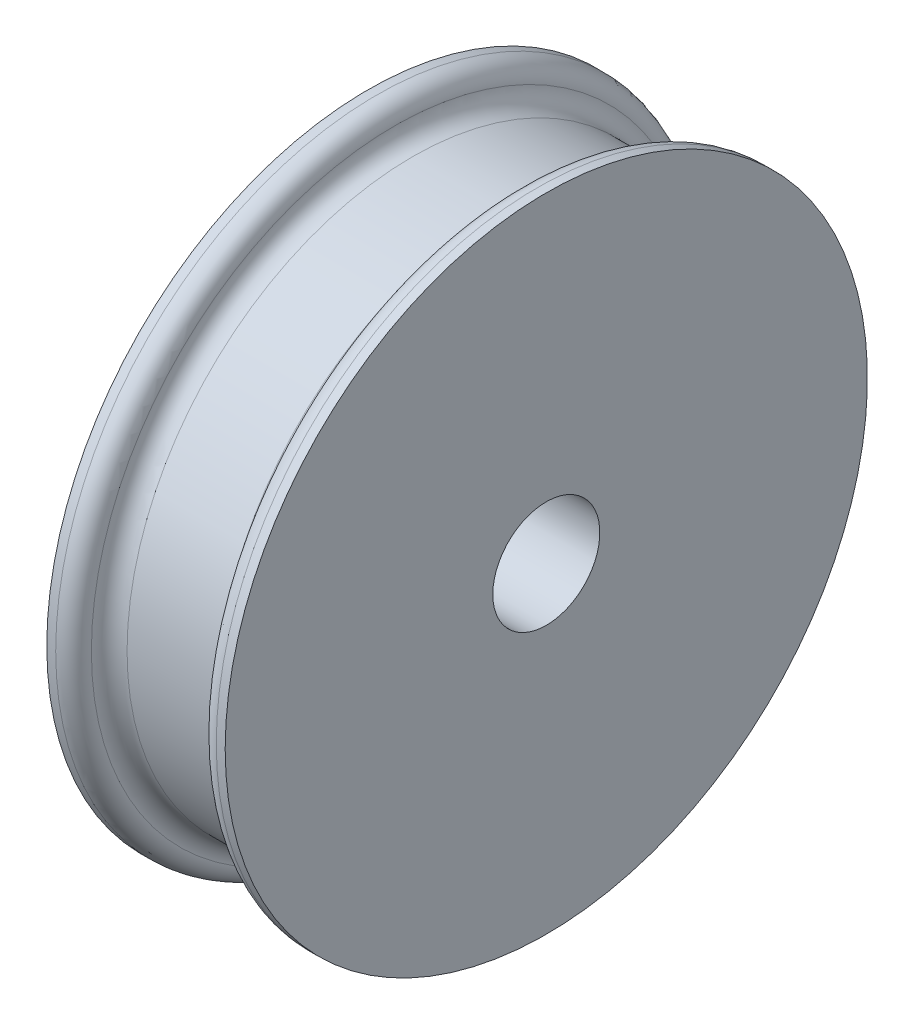
ISO-10303-21;
HEADER;
FILE_DESCRIPTION(('STEP AP214'),'2;1');
FILE_NAME('part.step','',(''),(''),'','','');
FILE_SCHEMA(('AUTOMOTIVE_DESIGN { 1 0 10303 214 1 1 1 1 }'));
ENDSEC;
DATA;
#1=APPLICATION_CONTEXT('core data for automotive mechanical design processes');
#2=APPLICATION_PROTOCOL_DEFINITION('international standard','automotive_design',2000,#1);
#3=PRODUCT_CONTEXT('',#1,'mechanical');
#4=PRODUCT('Part','Part','',(#3));
#5=PRODUCT_RELATED_PRODUCT_CATEGORY('part','',(#4));
#6=PRODUCT_DEFINITION_FORMATION('','',#4);
#7=PRODUCT_DEFINITION_CONTEXT('part definition',#1,'design');
#8=PRODUCT_DEFINITION('design','',#6,#7);
#9=PRODUCT_DEFINITION_SHAPE('','',#8);
#10=(LENGTH_UNIT() NAMED_UNIT(*) SI_UNIT(.MILLI.,.METRE.));
#11=(NAMED_UNIT(*) PLANE_ANGLE_UNIT() SI_UNIT($,.RADIAN.));
#12=(NAMED_UNIT(*) SI_UNIT($,.STERADIAN.) SOLID_ANGLE_UNIT());
#13=UNCERTAINTY_MEASURE_WITH_UNIT(LENGTH_MEASURE(1.E-05),#10,'distance_accuracy_value','');
#14=(GEOMETRIC_REPRESENTATION_CONTEXT(3) GLOBAL_UNCERTAINTY_ASSIGNED_CONTEXT((#13)) GLOBAL_UNIT_ASSIGNED_CONTEXT((#10,
#11,#12)) REPRESENTATION_CONTEXT('',''));
#15=CARTESIAN_POINT('',(0.,0.,0.));
#16=DIRECTION('',(0.,0.,1.));
#17=DIRECTION('',(1.,0.,0.));
#18=AXIS2_PLACEMENT_3D('',#15,#16,#17);
#19=CARTESIAN_POINT('',(2.5,1.5,0.));
#20=DIRECTION('',(-1.,0.,0.));
#21=DIRECTION('',(0.,0.,1.));
#22=AXIS2_PLACEMENT_3D('',#19,#20,#21);
#23=PLANE('',#22);
#24=CARTESIAN_POINT('',(2.5,0.,0.));
#25=DIRECTION('',(-1.,0.,0.));
#26=DIRECTION('',(0.,0.,1.));
#27=AXIS2_PLACEMENT_3D('',#24,#25,#26);
#28=CIRCLE('',#27,9.);
#29=CARTESIAN_POINT('',(2.5,0.,9.));
#30=VERTEX_POINT('',#29);
#31=EDGE_CURVE('E65',#30,#30,#28,.T.);
#32=ORIENTED_EDGE('',*,*,#31,.F.);
#33=EDGE_LOOP('',(#32));
#34=FACE_BOUND('',#33,.T.);
#35=CARTESIAN_POINT('',(2.5,0.,0.));
#36=DIRECTION('',(-1.,0.,0.));
#37=DIRECTION('',(0.,0.,1.));
#38=AXIS2_PLACEMENT_3D('',#35,#36,#37);
#39=CIRCLE('',#38,1.5);
#40=CARTESIAN_POINT('',(2.5,0.,1.5));
#41=VERTEX_POINT('',#40);
#42=EDGE_CURVE('E41',#41,#41,#39,.T.);
#43=ORIENTED_EDGE('',*,*,#42,.T.);
#44=EDGE_LOOP('',(#43));
#45=FACE_BOUND('',#44,.T.);
#46=ADVANCED_FACE('F30',(#34,#45),#23,.F.);
#47=CARTESIAN_POINT('',(0.,0.,0.));
#48=DIRECTION('',(-1.,0.,0.));
#49=DIRECTION('',(0.,0.,1.));
#50=AXIS2_PLACEMENT_3D('',#47,#48,#49);
#51=CYLINDRICAL_SURFACE('',#50,1.5);
#52=ORIENTED_EDGE('',*,*,#42,.F.);
#53=EDGE_LOOP('',(#52));
#54=FACE_BOUND('',#53,.T.);
#55=CARTESIAN_POINT('',(-2.5,0.,0.));
#56=DIRECTION('',(-1.,0.,0.));
#57=DIRECTION('',(0.,0.,1.));
#58=AXIS2_PLACEMENT_3D('',#55,#56,#57);
#59=CIRCLE('',#58,1.5);
#60=CARTESIAN_POINT('',(-2.5,0.,1.5));
#61=VERTEX_POINT('',#60);
#62=EDGE_CURVE('E45',#61,#61,#59,.T.);
#63=ORIENTED_EDGE('',*,*,#62,.T.);
#64=EDGE_LOOP('',(#63));
#65=FACE_BOUND('',#64,.T.);
#66=ADVANCED_FACE('F73',(#54,#65),#51,.F.);
#67=CARTESIAN_POINT('',(-2.5,1.5,0.));
#68=DIRECTION('',(1.,0.,0.));
#69=DIRECTION('',(0.,0.,-1.));
#70=AXIS2_PLACEMENT_3D('',#67,#68,#69);
#71=PLANE('',#70);
#72=ORIENTED_EDGE('',*,*,#62,.F.);
#73=EDGE_LOOP('',(#72));
#74=FACE_BOUND('',#73,.T.);
#75=CARTESIAN_POINT('',(-2.5,0.,0.));
#76=DIRECTION('',(-1.,0.,0.));
#77=DIRECTION('',(0.,0.,1.));
#78=AXIS2_PLACEMENT_3D('',#75,#76,#77);
#79=CIRCLE('',#78,9.);
#80=CARTESIAN_POINT('',(-2.5,0.,9.));
#81=VERTEX_POINT('',#80);
#82=EDGE_CURVE('E50',#81,#81,#79,.T.);
#83=ORIENTED_EDGE('',*,*,#82,.T.);
#84=EDGE_LOOP('',(#83));
#85=FACE_BOUND('',#84,.T.);
#86=ADVANCED_FACE('F79',(#74,#85),#71,.F.);
#87=CARTESIAN_POINT('',(0.,0.,0.));
#88=DIRECTION('',(-1.,0.,0.));
#89=DIRECTION('',(0.,0.,1.));
#90=AXIS2_PLACEMENT_3D('',#87,#88,#89);
#91=CYLINDRICAL_SURFACE('',#90,9.);
#92=CARTESIAN_POINT('',(-2.25,0.,0.));
#93=DIRECTION('',(-1.,0.,0.));
#94=DIRECTION('',(0.,0.,1.));
#95=AXIS2_PLACEMENT_3D('',#92,#93,#94);
#96=CIRCLE('',#95,9.);
#97=CARTESIAN_POINT('',(-2.25,0.,9.));
#98=VERTEX_POINT('',#97);
#99=EDGE_CURVE('E37',#98,#98,#96,.T.);
#100=ORIENTED_EDGE('',*,*,#99,.T.);
#101=EDGE_LOOP('',(#100));
#102=FACE_BOUND('',#101,.T.);
#103=ORIENTED_EDGE('',*,*,#82,.F.);
#104=EDGE_LOOP('',(#103));
#105=FACE_BOUND('',#104,.T.);
#106=ADVANCED_FACE('F85',(#102,#105),#91,.T.);
#107=CARTESIAN_POINT('',(-1.25,0.,0.));
#108=DIRECTION('',(-1.,0.,0.));
#109=DIRECTION('',(0.,0.,1.));
#110=AXIS2_PLACEMENT_3D('',#107,#108,#109);
#111=TOROIDAL_SURFACE('',#110,8.5,0.5);
#112=CARTESIAN_POINT('',(-1.75,0.,0.));
#113=DIRECTION('',(-1.,0.,0.));
#114=DIRECTION('',(0.,0.,1.));
#115=AXIS2_PLACEMENT_3D('',#112,#113,#114);
#116=CIRCLE('',#115,8.5);
#117=CARTESIAN_POINT('',(-1.75,0.,8.5));
#118=VERTEX_POINT('',#117);
#119=EDGE_CURVE('E53',#118,#118,#116,.T.);
#120=ORIENTED_EDGE('',*,*,#119,.F.);
#121=EDGE_LOOP('',(#120));
#122=FACE_BOUND('',#121,.T.);
#123=CARTESIAN_POINT('',(-1.25,0.,0.));
#124=DIRECTION('',(-1.,0.,0.));
#125=DIRECTION('',(0.,0.,1.));
#126=AXIS2_PLACEMENT_3D('',#123,#124,#125);
#127=CIRCLE('',#126,8.);
#128=CARTESIAN_POINT('',(-1.25,0.,8.));
#129=VERTEX_POINT('',#128);
#130=EDGE_CURVE('E56',#129,#129,#127,.T.);
#131=ORIENTED_EDGE('',*,*,#130,.T.);
#132=EDGE_LOOP('',(#131));
#133=FACE_BOUND('',#132,.T.);
#134=ADVANCED_FACE('F90',(#122,#133),#111,.F.);
#135=CARTESIAN_POINT('',(0.,0.,0.));
#136=DIRECTION('',(-1.,0.,0.));
#137=DIRECTION('',(0.,0.,1.));
#138=AXIS2_PLACEMENT_3D('',#135,#136,#137);
#139=CYLINDRICAL_SURFACE('',#138,8.);
#140=ORIENTED_EDGE('',*,*,#130,.F.);
#141=EDGE_LOOP('',(#140));
#142=FACE_BOUND('',#141,.T.);
#143=CARTESIAN_POINT('',(1.25,0.,0.));
#144=DIRECTION('',(-1.,0.,0.));
#145=DIRECTION('',(0.,0.,1.));
#146=AXIS2_PLACEMENT_3D('',#143,#144,#145);
#147=CIRCLE('',#146,8.);
#148=CARTESIAN_POINT('',(1.25,0.,8.));
#149=VERTEX_POINT('',#148);
#150=EDGE_CURVE('E59',#149,#149,#147,.T.);
#151=ORIENTED_EDGE('',*,*,#150,.T.);
#152=EDGE_LOOP('',(#151));
#153=FACE_BOUND('',#152,.T.);
#154=ADVANCED_FACE('F95',(#142,#153),#139,.T.);
#155=CARTESIAN_POINT('',(1.25,0.,0.));
#156=DIRECTION('',(-1.,0.,0.));
#157=DIRECTION('',(0.,0.,1.));
#158=AXIS2_PLACEMENT_3D('',#155,#156,#157);
#159=TOROIDAL_SURFACE('',#158,8.5,0.5);
#160=ORIENTED_EDGE('',*,*,#150,.F.);
#161=EDGE_LOOP('',(#160));
#162=FACE_BOUND('',#161,.T.);
#163=CARTESIAN_POINT('',(1.75,0.,0.));
#164=DIRECTION('',(-1.,0.,0.));
#165=DIRECTION('',(0.,0.,1.));
#166=AXIS2_PLACEMENT_3D('',#163,#164,#165);
#167=CIRCLE('',#166,8.5);
#168=CARTESIAN_POINT('',(1.75,0.,8.5));
#169=VERTEX_POINT('',#168);
#170=EDGE_CURVE('E62',#169,#169,#167,.T.);
#171=ORIENTED_EDGE('',*,*,#170,.T.);
#172=EDGE_LOOP('',(#171));
#173=FACE_BOUND('',#172,.T.);
#174=ADVANCED_FACE('F107',(#162,#173),#159,.F.);
#175=CARTESIAN_POINT('',(0.,0.,0.));
#176=DIRECTION('',(-1.,0.,0.));
#177=DIRECTION('',(0.,0.,1.));
#178=AXIS2_PLACEMENT_3D('',#175,#176,#177);
#179=CYLINDRICAL_SURFACE('',#178,9.);
#180=CARTESIAN_POINT('',(2.25,0.,0.));
#181=DIRECTION('',(1.,0.,0.));
#182=DIRECTION('',(0.,0.,-1.));
#183=AXIS2_PLACEMENT_3D('',#180,#181,#182);
#184=CIRCLE('',#183,9.);
#185=CARTESIAN_POINT('',(2.25,0.,-9.));
#186=VERTEX_POINT('',#185);
#187=EDGE_CURVE('E10',#186,#186,#184,.T.);
#188=ORIENTED_EDGE('',*,*,#187,.T.);
#189=EDGE_LOOP('',(#188));
#190=FACE_BOUND('',#189,.T.);
#191=ORIENTED_EDGE('',*,*,#31,.T.);
#192=EDGE_LOOP('',(#191));
#193=FACE_BOUND('',#192,.T.);
#194=ADVANCED_FACE('F69',(#190,#193),#179,.T.);
#195=CARTESIAN_POINT('',(-2.25,0.,0.));
#196=DIRECTION('',(-1.,0.,0.));
#197=DIRECTION('',(0.,0.,1.));
#198=AXIS2_PLACEMENT_3D('',#195,#196,#197);
#199=TOROIDAL_SURFACE('',#198,8.5,0.5);
#200=ORIENTED_EDGE('',*,*,#119,.T.);
#201=EDGE_LOOP('',(#200));
#202=FACE_BOUND('',#201,.T.);
#203=ORIENTED_EDGE('',*,*,#99,.F.);
#204=EDGE_LOOP('',(#203));
#205=FACE_BOUND('',#204,.T.);
#206=ADVANCED_FACE('F99',(#202,#205),#199,.T.);
#207=CARTESIAN_POINT('',(2.25,0.,0.));
#208=DIRECTION('',(1.,0.,0.));
#209=DIRECTION('',(0.,0.,-1.));
#210=AXIS2_PLACEMENT_3D('',#207,#208,#209);
#211=TOROIDAL_SURFACE('',#210,8.5,0.5);
#212=ORIENTED_EDGE('',*,*,#187,.F.);
#213=EDGE_LOOP('',(#212));
#214=FACE_BOUND('',#213,.T.);
#215=ORIENTED_EDGE('',*,*,#170,.F.);
#216=EDGE_LOOP('',(#215));
#217=FACE_BOUND('',#216,.T.);
#218=ADVANCED_FACE('F32',(#214,#217),#211,.T.);
#219=CLOSED_SHELL('',(#46,#66,#86,#106,#134,#154,#174,#194,#206,#218));
#220=MANIFOLD_SOLID_BREP('B2',#219);
#221=ADVANCED_BREP_SHAPE_REPRESENTATION('',(#18,#220),#14);
#222=SHAPE_DEFINITION_REPRESENTATION(#9,#221);
ENDSEC;
END-ISO-10303-21;
